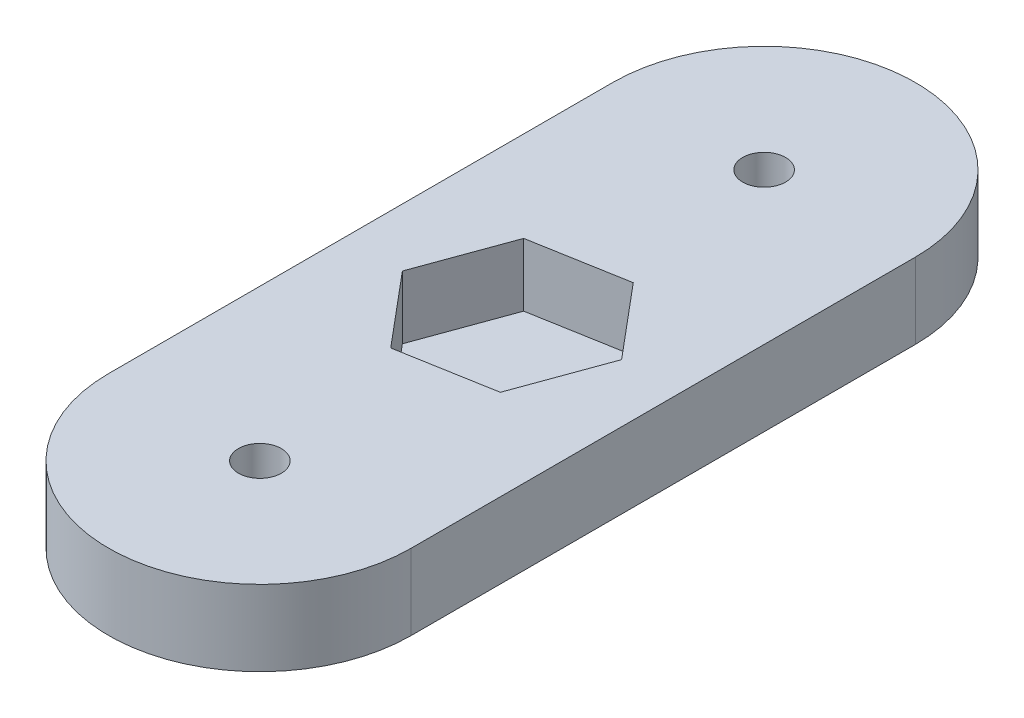
ISO-10303-21;
HEADER;
FILE_DESCRIPTION(('STEP AP214'),'2;1');
FILE_NAME('part.step','',(''),(''),'','','');
FILE_SCHEMA(('AUTOMOTIVE_DESIGN { 1 0 10303 214 1 1 1 1 }'));
ENDSEC;
DATA;
#1=APPLICATION_CONTEXT('core data for automotive mechanical design processes');
#2=APPLICATION_PROTOCOL_DEFINITION('international standard','automotive_design',2000,#1);
#3=PRODUCT_CONTEXT('',#1,'mechanical');
#4=PRODUCT('Part','Part','',(#3));
#5=PRODUCT_RELATED_PRODUCT_CATEGORY('part','',(#4));
#6=PRODUCT_DEFINITION_FORMATION('','',#4);
#7=PRODUCT_DEFINITION_CONTEXT('part definition',#1,'design');
#8=PRODUCT_DEFINITION('design','',#6,#7);
#9=PRODUCT_DEFINITION_SHAPE('','',#8);
#10=(LENGTH_UNIT() NAMED_UNIT(*) SI_UNIT(.MILLI.,.METRE.));
#11=(NAMED_UNIT(*) PLANE_ANGLE_UNIT() SI_UNIT($,.RADIAN.));
#12=(NAMED_UNIT(*) SI_UNIT($,.STERADIAN.) SOLID_ANGLE_UNIT());
#13=UNCERTAINTY_MEASURE_WITH_UNIT(LENGTH_MEASURE(1.E-05),#10,'distance_accuracy_value','');
#14=(GEOMETRIC_REPRESENTATION_CONTEXT(3) GLOBAL_UNCERTAINTY_ASSIGNED_CONTEXT((#13)) GLOBAL_UNIT_ASSIGNED_CONTEXT((#10,
#11,#12)) REPRESENTATION_CONTEXT('',''));
#15=CARTESIAN_POINT('',(0.,0.,0.));
#16=DIRECTION('',(0.,0.,1.));
#17=DIRECTION('',(1.,0.,0.));
#18=AXIS2_PLACEMENT_3D('',#15,#16,#17);
#19=CARTESIAN_POINT('',(0.,6.,0.));
#20=DIRECTION('',(0.,1.,0.));
#21=DIRECTION('',(0.,0.,1.));
#22=AXIS2_PLACEMENT_3D('',#19,#20,#21);
#23=PLANE('',#22);
#24=DIRECTION('',(0.984807753012207,0.,-0.173648177666934));
#25=VECTOR('',#24,1.);
#26=CARTESIAN_POINT('',(-2.56705048362551,6.,-12.9470867616387));
#27=LINE('',#26,#25);
#28=CARTESIAN_POINT('',(-2.56705048362551,6.,-12.9470867616387));
#29=VERTEX_POINT('',#28);
#30=CARTESIAN_POINT('',(4.82447679329566,6.,-14.2504124492026));
#31=VERTEX_POINT('',#30);
#32=EDGE_CURVE('E48',#29,#31,#27,.T.);
#33=ORIENTED_EDGE('',*,*,#32,.F.);
#34=DIRECTION('',(0.642787609686542,0.,0.766044443118975));
#35=VECTOR('',#34,1.);
#36=CARTESIAN_POINT('',(-7.39152727692117,6.,-18.6966743124362));
#37=LINE('',#36,#35);
#38=CARTESIAN_POINT('',(-7.39152727692117,6.,-18.6966743124362));
#39=VERTEX_POINT('',#38);
#40=EDGE_CURVE('E140',#39,#29,#37,.T.);
#41=ORIENTED_EDGE('',*,*,#40,.F.);
#42=DIRECTION('',(-0.342020143325665,0.,0.93969262078591));
#43=VECTOR('',#42,1.);
#44=CARTESIAN_POINT('',(-4.82447679329565,6.,-25.7495875507974));
#45=LINE('',#44,#43);
#46=CARTESIAN_POINT('',(-4.82447679329565,6.,-25.7495875507974));
#47=VERTEX_POINT('',#46);
#48=EDGE_CURVE('E143',#47,#39,#45,.T.);
#49=ORIENTED_EDGE('',*,*,#48,.F.);
#50=DIRECTION('',(-0.984807753012207,0.,0.173648177666934));
#51=VECTOR('',#50,1.);
#52=CARTESIAN_POINT('',(2.56705048362551,6.,-27.0529132383612));
#53=LINE('',#52,#51);
#54=CARTESIAN_POINT('',(2.56705048362551,6.,-27.0529132383612));
#55=VERTEX_POINT('',#54);
#56=EDGE_CURVE('E159',#55,#47,#53,.T.);
#57=ORIENTED_EDGE('',*,*,#56,.F.);
#58=DIRECTION('',(-0.642787609686543,0.,-0.766044443118975));
#59=VECTOR('',#58,1.);
#60=CARTESIAN_POINT('',(7.39152727692117,6.,-21.3033256875638));
#61=LINE('',#60,#59);
#62=CARTESIAN_POINT('',(7.39152727692117,6.,-21.3033256875638));
#63=VERTEX_POINT('',#62);
#64=EDGE_CURVE('E156',#63,#55,#61,.T.);
#65=ORIENTED_EDGE('',*,*,#64,.F.);
#66=DIRECTION('',(0.342020143325665,0.,-0.93969262078591));
#67=VECTOR('',#66,1.);
#68=CARTESIAN_POINT('',(4.82447679329566,6.,-14.2504124492026));
#69=LINE('',#68,#67);
#70=EDGE_CURVE('E154',#31,#63,#69,.T.);
#71=ORIENTED_EDGE('',*,*,#70,.F.);
#72=EDGE_LOOP('',(#33,#41,#49,#57,#65,#71));
#73=FACE_BOUND('',#72,.T.);
#74=CARTESIAN_POINT('',(0.,6.,-40.));
#75=DIRECTION('',(0.,1.,0.));
#76=DIRECTION('',(0.,0.,1.));
#77=AXIS2_PLACEMENT_3D('',#74,#75,#76);
#78=CIRCLE('',#77,1.7);
#79=CARTESIAN_POINT('',(0.,6.,-38.3));
#80=VERTEX_POINT('',#79);
#81=EDGE_CURVE('E180',#80,#80,#78,.T.);
#82=ORIENTED_EDGE('',*,*,#81,.F.);
#83=EDGE_LOOP('',(#82));
#84=FACE_BOUND('',#83,.T.);
#85=CARTESIAN_POINT('',(0.,6.,0.));
#86=DIRECTION('',(0.,1.,0.));
#87=DIRECTION('',(0.,0.,1.));
#88=AXIS2_PLACEMENT_3D('',#85,#86,#87);
#89=CIRCLE('',#88,12.);
#90=CARTESIAN_POINT('',(-12.,6.,0.));
#91=VERTEX_POINT('',#90);
#92=CARTESIAN_POINT('',(12.,6.,0.));
#93=VERTEX_POINT('',#92);
#94=EDGE_CURVE('E186',#91,#93,#89,.T.);
#95=ORIENTED_EDGE('',*,*,#94,.T.);
#96=DIRECTION('',(0.,0.,-1.));
#97=VECTOR('',#96,1.);
#98=CARTESIAN_POINT('',(12.,6.,0.));
#99=LINE('',#98,#97);
#100=CARTESIAN_POINT('',(12.,6.,-40.));
#101=VERTEX_POINT('',#100);
#102=EDGE_CURVE('E85',#93,#101,#99,.T.);
#103=ORIENTED_EDGE('',*,*,#102,.T.);
#104=CARTESIAN_POINT('',(0.,6.,-40.));
#105=DIRECTION('',(0.,1.,0.));
#106=DIRECTION('',(0.,0.,1.));
#107=AXIS2_PLACEMENT_3D('',#104,#105,#106);
#108=CIRCLE('',#107,12.);
#109=CARTESIAN_POINT('',(-12.,6.,-40.));
#110=VERTEX_POINT('',#109);
#111=EDGE_CURVE('E189',#101,#110,#108,.T.);
#112=ORIENTED_EDGE('',*,*,#111,.T.);
#113=DIRECTION('',(0.,0.,1.));
#114=VECTOR('',#113,1.);
#115=CARTESIAN_POINT('',(-12.,6.,0.));
#116=LINE('',#115,#114);
#117=EDGE_CURVE('E57',#110,#91,#116,.T.);
#118=ORIENTED_EDGE('',*,*,#117,.T.);
#119=EDGE_LOOP('',(#95,#103,#112,#118));
#120=FACE_BOUND('',#119,.T.);
#121=CARTESIAN_POINT('',(0.,6.,0.));
#122=DIRECTION('',(0.,1.,0.));
#123=DIRECTION('',(0.,0.,1.));
#124=AXIS2_PLACEMENT_3D('',#121,#122,#123);
#125=CIRCLE('',#124,1.7);
#126=CARTESIAN_POINT('',(0.,6.,1.7));
#127=VERTEX_POINT('',#126);
#128=EDGE_CURVE('E174',#127,#127,#125,.T.);
#129=ORIENTED_EDGE('',*,*,#128,.F.);
#130=EDGE_LOOP('',(#129));
#131=FACE_BOUND('',#130,.T.);
#132=ADVANCED_FACE('F33',(#73,#84,#120,#131),#23,.T.);
#133=CARTESIAN_POINT('',(0.,0.,0.));
#134=DIRECTION('',(0.,1.,0.));
#135=DIRECTION('',(0.,0.,1.));
#136=AXIS2_PLACEMENT_3D('',#133,#134,#135);
#137=PLANE('',#136);
#138=CARTESIAN_POINT('',(0.,0.,-40.));
#139=DIRECTION('',(0.,1.,0.));
#140=DIRECTION('',(0.,0.,1.));
#141=AXIS2_PLACEMENT_3D('',#138,#139,#140);
#142=CIRCLE('',#141,1.7);
#143=CARTESIAN_POINT('',(0.,0.,-38.3));
#144=VERTEX_POINT('',#143);
#145=EDGE_CURVE('E177',#144,#144,#142,.T.);
#146=ORIENTED_EDGE('',*,*,#145,.T.);
#147=EDGE_LOOP('',(#146));
#148=FACE_BOUND('',#147,.T.);
#149=CARTESIAN_POINT('',(0.,0.,0.));
#150=DIRECTION('',(0.,1.,0.));
#151=DIRECTION('',(0.,0.,1.));
#152=AXIS2_PLACEMENT_3D('',#149,#150,#151);
#153=CIRCLE('',#152,12.);
#154=CARTESIAN_POINT('',(-12.,0.,0.));
#155=VERTEX_POINT('',#154);
#156=CARTESIAN_POINT('',(12.,0.,0.));
#157=VERTEX_POINT('',#156);
#158=EDGE_CURVE('E183',#155,#157,#153,.T.);
#159=ORIENTED_EDGE('',*,*,#158,.F.);
#160=DIRECTION('',(0.,0.,1.));
#161=VECTOR('',#160,1.);
#162=CARTESIAN_POINT('',(-12.,0.,0.));
#163=LINE('',#162,#161);
#164=CARTESIAN_POINT('',(-12.,0.,-40.));
#165=VERTEX_POINT('',#164);
#166=EDGE_CURVE('E78',#165,#155,#163,.T.);
#167=ORIENTED_EDGE('',*,*,#166,.F.);
#168=CARTESIAN_POINT('',(0.,0.,-40.));
#169=DIRECTION('',(0.,1.,0.));
#170=DIRECTION('',(0.,0.,1.));
#171=AXIS2_PLACEMENT_3D('',#168,#169,#170);
#172=CIRCLE('',#171,12.);
#173=CARTESIAN_POINT('',(12.,0.,-40.));
#174=VERTEX_POINT('',#173);
#175=EDGE_CURVE('E197',#174,#165,#172,.T.);
#176=ORIENTED_EDGE('',*,*,#175,.F.);
#177=DIRECTION('',(0.,0.,-1.));
#178=VECTOR('',#177,1.);
#179=CARTESIAN_POINT('',(12.,0.,0.));
#180=LINE('',#179,#178);
#181=EDGE_CURVE('E195',#157,#174,#180,.T.);
#182=ORIENTED_EDGE('',*,*,#181,.F.);
#183=EDGE_LOOP('',(#159,#167,#176,#182));
#184=FACE_BOUND('',#183,.T.);
#185=CARTESIAN_POINT('',(0.,0.,0.));
#186=DIRECTION('',(0.,1.,0.));
#187=DIRECTION('',(0.,0.,1.));
#188=AXIS2_PLACEMENT_3D('',#185,#186,#187);
#189=CIRCLE('',#188,1.7);
#190=CARTESIAN_POINT('',(0.,0.,1.7));
#191=VERTEX_POINT('',#190);
#192=EDGE_CURVE('E166',#191,#191,#189,.T.);
#193=ORIENTED_EDGE('',*,*,#192,.T.);
#194=EDGE_LOOP('',(#193));
#195=FACE_BOUND('',#194,.T.);
#196=ADVANCED_FACE('F210',(#148,#184,#195),#137,.F.);
#197=CARTESIAN_POINT('',(0.,6.,0.));
#198=DIRECTION('',(0.,-1.,0.));
#199=DIRECTION('',(0.,0.,-1.));
#200=AXIS2_PLACEMENT_3D('',#197,#198,#199);
#201=CYLINDRICAL_SURFACE('',#200,12.);
#202=ORIENTED_EDGE('',*,*,#158,.T.);
#203=DIRECTION('',(0.,-1.,0.));
#204=VECTOR('',#203,1.);
#205=CARTESIAN_POINT('',(12.,6.,0.));
#206=LINE('',#205,#204);
#207=EDGE_CURVE('E11',#93,#157,#206,.T.);
#208=ORIENTED_EDGE('',*,*,#207,.F.);
#209=ORIENTED_EDGE('',*,*,#94,.F.);
#210=DIRECTION('',(0.,-1.,0.));
#211=VECTOR('',#210,1.);
#212=CARTESIAN_POINT('',(-12.,6.,0.));
#213=LINE('',#212,#211);
#214=EDGE_CURVE('E192',#91,#155,#213,.T.);
#215=ORIENTED_EDGE('',*,*,#214,.T.);
#216=EDGE_LOOP('',(#202,#208,#209,#215));
#217=FACE_BOUND('',#216,.T.);
#218=ADVANCED_FACE('F35',(#217),#201,.T.);
#219=CARTESIAN_POINT('',(12.,6.,0.));
#220=DIRECTION('',(-1.,0.,0.));
#221=DIRECTION('',(0.,0.,1.));
#222=AXIS2_PLACEMENT_3D('',#219,#220,#221);
#223=PLANE('',#222);
#224=ORIENTED_EDGE('',*,*,#181,.T.);
#225=DIRECTION('',(0.,-1.,0.));
#226=VECTOR('',#225,1.);
#227=CARTESIAN_POINT('',(12.,6.,-40.));
#228=LINE('',#227,#226);
#229=EDGE_CURVE('E41',#101,#174,#228,.T.);
#230=ORIENTED_EDGE('',*,*,#229,.F.);
#231=ORIENTED_EDGE('',*,*,#102,.F.);
#232=ORIENTED_EDGE('',*,*,#207,.T.);
#233=EDGE_LOOP('',(#224,#230,#231,#232));
#234=FACE_BOUND('',#233,.T.);
#235=ADVANCED_FACE('F226',(#234),#223,.F.);
#236=CARTESIAN_POINT('',(0.,6.,-40.));
#237=DIRECTION('',(0.,-1.,0.));
#238=DIRECTION('',(0.,0.,-1.));
#239=AXIS2_PLACEMENT_3D('',#236,#237,#238);
#240=CYLINDRICAL_SURFACE('',#239,12.);
#241=ORIENTED_EDGE('',*,*,#175,.T.);
#242=DIRECTION('',(0.,-1.,0.));
#243=VECTOR('',#242,1.);
#244=CARTESIAN_POINT('',(-12.,6.,-40.));
#245=LINE('',#244,#243);
#246=EDGE_CURVE('E201',#110,#165,#245,.T.);
#247=ORIENTED_EDGE('',*,*,#246,.F.);
#248=ORIENTED_EDGE('',*,*,#111,.F.);
#249=ORIENTED_EDGE('',*,*,#229,.T.);
#250=EDGE_LOOP('',(#241,#247,#248,#249));
#251=FACE_BOUND('',#250,.T.);
#252=ADVANCED_FACE('F206',(#251),#240,.T.);
#253=CARTESIAN_POINT('',(-12.,6.,0.));
#254=DIRECTION('',(1.,0.,0.));
#255=DIRECTION('',(0.,0.,-1.));
#256=AXIS2_PLACEMENT_3D('',#253,#254,#255);
#257=PLANE('',#256);
#258=ORIENTED_EDGE('',*,*,#166,.T.);
#259=ORIENTED_EDGE('',*,*,#214,.F.);
#260=ORIENTED_EDGE('',*,*,#117,.F.);
#261=ORIENTED_EDGE('',*,*,#246,.T.);
#262=EDGE_LOOP('',(#258,#259,#260,#261));
#263=FACE_BOUND('',#262,.T.);
#264=ADVANCED_FACE('F215',(#263),#257,.F.);
#265=CARTESIAN_POINT('',(0.,6.,-40.));
#266=DIRECTION('',(0.,-1.,0.));
#267=DIRECTION('',(0.,0.,-1.));
#268=AXIS2_PLACEMENT_3D('',#265,#266,#267);
#269=CYLINDRICAL_SURFACE('',#268,1.7);
#270=ORIENTED_EDGE('',*,*,#81,.T.);
#271=EDGE_LOOP('',(#270));
#272=FACE_BOUND('',#271,.T.);
#273=ORIENTED_EDGE('',*,*,#145,.F.);
#274=EDGE_LOOP('',(#273));
#275=FACE_BOUND('',#274,.T.);
#276=ADVANCED_FACE('F217',(#272,#275),#269,.F.);
#277=CARTESIAN_POINT('',(0.,6.,0.));
#278=DIRECTION('',(0.,-1.,0.));
#279=DIRECTION('',(0.,0.,-1.));
#280=AXIS2_PLACEMENT_3D('',#277,#278,#279);
#281=CYLINDRICAL_SURFACE('',#280,1.7);
#282=ORIENTED_EDGE('',*,*,#128,.T.);
#283=EDGE_LOOP('',(#282));
#284=FACE_BOUND('',#283,.T.);
#285=ORIENTED_EDGE('',*,*,#192,.F.);
#286=EDGE_LOOP('',(#285));
#287=FACE_BOUND('',#286,.T.);
#288=ADVANCED_FACE('F223',(#284,#287),#281,.F.);
#289=CARTESIAN_POINT('',(-2.56705048362551,1.,-12.9470867616387));
#290=DIRECTION('',(0.173648177666934,0.,0.984807753012207));
#291=DIRECTION('',(0.984807753012207,0.,-0.173648177666934));
#292=AXIS2_PLACEMENT_3D('',#289,#290,#291);
#293=PLANE('',#292);
#294=ORIENTED_EDGE('',*,*,#32,.T.);
#295=DIRECTION('',(0.,1.,0.));
#296=VECTOR('',#295,1.);
#297=CARTESIAN_POINT('',(4.82447679329566,1.,-14.2504124492026));
#298=LINE('',#297,#296);
#299=CARTESIAN_POINT('',(4.82447679329566,1.,-14.2504124492026));
#300=VERTEX_POINT('',#299);
#301=EDGE_CURVE('E117',#300,#31,#298,.T.);
#302=ORIENTED_EDGE('',*,*,#301,.F.);
#303=DIRECTION('',(0.984807753012207,0.,-0.173648177666934));
#304=VECTOR('',#303,1.);
#305=CARTESIAN_POINT('',(-2.56705048362551,1.,-12.9470867616387));
#306=LINE('',#305,#304);
#307=CARTESIAN_POINT('',(-2.56705048362551,1.,-12.9470867616387));
#308=VERTEX_POINT('',#307);
#309=EDGE_CURVE('E121',#308,#300,#306,.T.);
#310=ORIENTED_EDGE('',*,*,#309,.F.);
#311=DIRECTION('',(0.,1.,0.));
#312=VECTOR('',#311,1.);
#313=CARTESIAN_POINT('',(-2.56705048362551,1.,-12.9470867616387));
#314=LINE('',#313,#312);
#315=EDGE_CURVE('E164',#308,#29,#314,.T.);
#316=ORIENTED_EDGE('',*,*,#315,.T.);
#317=EDGE_LOOP('',(#294,#302,#310,#316));
#318=FACE_BOUND('',#317,.T.);
#319=ADVANCED_FACE('F119',(#318),#293,.F.);
#320=CARTESIAN_POINT('',(-7.39152727692117,1.,-18.6966743124362));
#321=DIRECTION('',(-0.766044443118975,0.,0.642787609686542));
#322=DIRECTION('',(0.642787609686542,0.,0.766044443118976));
#323=AXIS2_PLACEMENT_3D('',#320,#321,#322);
#324=PLANE('',#323);
#325=ORIENTED_EDGE('',*,*,#40,.T.);
#326=ORIENTED_EDGE('',*,*,#315,.F.);
#327=DIRECTION('',(0.642787609686542,0.,0.766044443118975));
#328=VECTOR('',#327,1.);
#329=CARTESIAN_POINT('',(-7.39152727692117,1.,-18.6966743124362));
#330=LINE('',#329,#328);
#331=CARTESIAN_POINT('',(-7.39152727692117,1.,-18.6966743124362));
#332=VERTEX_POINT('',#331);
#333=EDGE_CURVE('E127',#332,#308,#330,.T.);
#334=ORIENTED_EDGE('',*,*,#333,.F.);
#335=DIRECTION('',(0.,1.,0.));
#336=VECTOR('',#335,1.);
#337=CARTESIAN_POINT('',(-7.39152727692117,1.,-18.6966743124362));
#338=LINE('',#337,#336);
#339=EDGE_CURVE('E167',#332,#39,#338,.T.);
#340=ORIENTED_EDGE('',*,*,#339,.T.);
#341=EDGE_LOOP('',(#325,#326,#334,#340));
#342=FACE_BOUND('',#341,.T.);
#343=ADVANCED_FACE('F243',(#342),#324,.F.);
#344=CARTESIAN_POINT('',(-4.82447679329565,1.,-25.7495875507974));
#345=DIRECTION('',(-0.93969262078591,0.,-0.342020143325665));
#346=DIRECTION('',(-0.342020143325665,0.,0.93969262078591));
#347=AXIS2_PLACEMENT_3D('',#344,#345,#346);
#348=PLANE('',#347);
#349=ORIENTED_EDGE('',*,*,#48,.T.);
#350=ORIENTED_EDGE('',*,*,#339,.F.);
#351=DIRECTION('',(-0.342020143325665,0.,0.93969262078591));
#352=VECTOR('',#351,1.);
#353=CARTESIAN_POINT('',(-4.82447679329565,1.,-25.7495875507974));
#354=LINE('',#353,#352);
#355=CARTESIAN_POINT('',(-4.82447679329565,1.,-25.7495875507974));
#356=VERTEX_POINT('',#355);
#357=EDGE_CURVE('E150',#356,#332,#354,.T.);
#358=ORIENTED_EDGE('',*,*,#357,.F.);
#359=DIRECTION('',(0.,1.,0.));
#360=VECTOR('',#359,1.);
#361=CARTESIAN_POINT('',(-4.82447679329565,1.,-25.7495875507974));
#362=LINE('',#361,#360);
#363=EDGE_CURVE('E169',#356,#47,#362,.T.);
#364=ORIENTED_EDGE('',*,*,#363,.T.);
#365=EDGE_LOOP('',(#349,#350,#358,#364));
#366=FACE_BOUND('',#365,.T.);
#367=ADVANCED_FACE('F253',(#366),#348,.F.);
#368=CARTESIAN_POINT('',(2.56705048362551,1.,-27.0529132383612));
#369=DIRECTION('',(-0.173648177666934,0.,-0.984807753012207));
#370=DIRECTION('',(-0.984807753012207,0.,0.173648177666934));
#371=AXIS2_PLACEMENT_3D('',#368,#369,#370);
#372=PLANE('',#371);
#373=ORIENTED_EDGE('',*,*,#56,.T.);
#374=ORIENTED_EDGE('',*,*,#363,.F.);
#375=DIRECTION('',(-0.984807753012207,0.,0.173648177666934));
#376=VECTOR('',#375,1.);
#377=CARTESIAN_POINT('',(2.56705048362551,1.,-27.0529132383612));
#378=LINE('',#377,#376);
#379=CARTESIAN_POINT('',(2.56705048362551,1.,-27.0529132383612));
#380=VERTEX_POINT('',#379);
#381=EDGE_CURVE('E147',#380,#356,#378,.T.);
#382=ORIENTED_EDGE('',*,*,#381,.F.);
#383=DIRECTION('',(0.,1.,0.));
#384=VECTOR('',#383,1.);
#385=CARTESIAN_POINT('',(2.56705048362551,1.,-27.0529132383612));
#386=LINE('',#385,#384);
#387=EDGE_CURVE('E171',#380,#55,#386,.T.);
#388=ORIENTED_EDGE('',*,*,#387,.T.);
#389=EDGE_LOOP('',(#373,#374,#382,#388));
#390=FACE_BOUND('',#389,.T.);
#391=ADVANCED_FACE('F249',(#390),#372,.F.);
#392=CARTESIAN_POINT('',(7.39152727692117,1.,-21.3033256875638));
#393=DIRECTION('',(0.766044443118975,0.,-0.642787609686543));
#394=DIRECTION('',(-0.642787609686543,0.,-0.766044443118975));
#395=AXIS2_PLACEMENT_3D('',#392,#393,#394);
#396=PLANE('',#395);
#397=ORIENTED_EDGE('',*,*,#64,.T.);
#398=ORIENTED_EDGE('',*,*,#387,.F.);
#399=DIRECTION('',(-0.642787609686543,0.,-0.766044443118975));
#400=VECTOR('',#399,1.);
#401=CARTESIAN_POINT('',(7.39152727692117,1.,-21.3033256875638));
#402=LINE('',#401,#400);
#403=CARTESIAN_POINT('',(7.39152727692117,1.,-21.3033256875638));
#404=VERTEX_POINT('',#403);
#405=EDGE_CURVE('E135',#404,#380,#402,.T.);
#406=ORIENTED_EDGE('',*,*,#405,.F.);
#407=DIRECTION('',(0.,1.,0.));
#408=VECTOR('',#407,1.);
#409=CARTESIAN_POINT('',(7.39152727692117,1.,-21.3033256875638));
#410=LINE('',#409,#408);
#411=EDGE_CURVE('E126',#404,#63,#410,.T.);
#412=ORIENTED_EDGE('',*,*,#411,.T.);
#413=EDGE_LOOP('',(#397,#398,#406,#412));
#414=FACE_BOUND('',#413,.T.);
#415=ADVANCED_FACE('F246',(#414),#396,.F.);
#416=CARTESIAN_POINT('',(4.82447679329566,1.,-14.2504124492026));
#417=DIRECTION('',(0.93969262078591,0.,0.342020143325665));
#418=DIRECTION('',(0.342020143325665,0.,-0.93969262078591));
#419=AXIS2_PLACEMENT_3D('',#416,#417,#418);
#420=PLANE('',#419);
#421=ORIENTED_EDGE('',*,*,#70,.T.);
#422=ORIENTED_EDGE('',*,*,#411,.F.);
#423=DIRECTION('',(0.342020143325665,0.,-0.93969262078591));
#424=VECTOR('',#423,1.);
#425=CARTESIAN_POINT('',(4.82447679329566,1.,-14.2504124492026));
#426=LINE('',#425,#424);
#427=EDGE_CURVE('E130',#300,#404,#426,.T.);
#428=ORIENTED_EDGE('',*,*,#427,.F.);
#429=ORIENTED_EDGE('',*,*,#301,.T.);
#430=EDGE_LOOP('',(#421,#422,#428,#429));
#431=FACE_BOUND('',#430,.T.);
#432=ADVANCED_FACE('F131',(#431),#420,.F.);
#433=CARTESIAN_POINT('',(0.,1.,0.));
#434=DIRECTION('',(0.,1.,0.));
#435=DIRECTION('',(0.,0.,1.));
#436=AXIS2_PLACEMENT_3D('',#433,#434,#435);
#437=PLANE('',#436);
#438=ORIENTED_EDGE('',*,*,#309,.T.);
#439=ORIENTED_EDGE('',*,*,#427,.T.);
#440=ORIENTED_EDGE('',*,*,#405,.T.);
#441=ORIENTED_EDGE('',*,*,#381,.T.);
#442=ORIENTED_EDGE('',*,*,#357,.T.);
#443=ORIENTED_EDGE('',*,*,#333,.T.);
#444=EDGE_LOOP('',(#438,#439,#440,#441,#442,#443));
#445=FACE_BOUND('',#444,.T.);
#446=ADVANCED_FACE('F137',(#445),#437,.T.);
#447=CLOSED_SHELL('',(#132,#196,#218,#235,#252,#264,#276,#288,#319,#343,#367,#391,#415,#432,#446));
#448=MANIFOLD_SOLID_BREP('B2',#447);
#449=ADVANCED_BREP_SHAPE_REPRESENTATION('',(#18,#448),#14);
#450=SHAPE_DEFINITION_REPRESENTATION(#9,#449);
ENDSEC;
END-ISO-10303-21;
